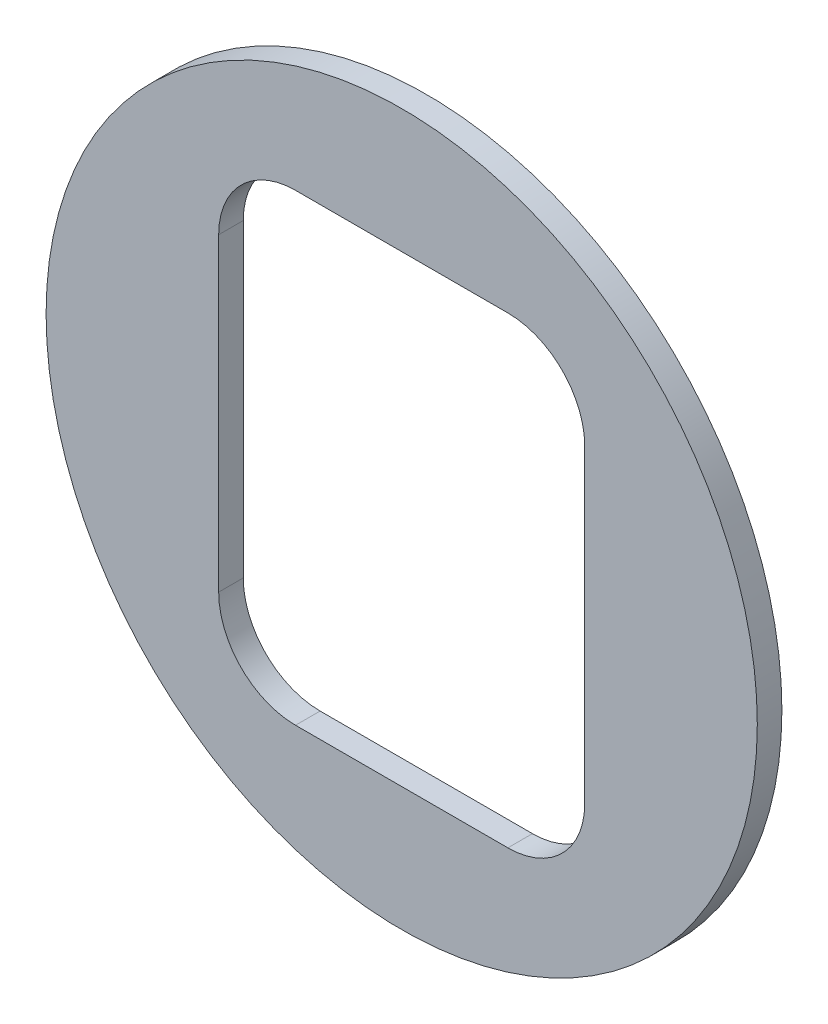
ISO-10303-21;
HEADER;
FILE_DESCRIPTION(('STEP AP214'),'2;1');
FILE_NAME('part.step','',(''),(''),'','','');
FILE_SCHEMA(('AUTOMOTIVE_DESIGN { 1 0 10303 214 1 1 1 1 }'));
ENDSEC;
DATA;
#1=APPLICATION_CONTEXT('core data for automotive mechanical design processes');
#2=APPLICATION_PROTOCOL_DEFINITION('international standard','automotive_design',2000,#1);
#3=PRODUCT_CONTEXT('',#1,'mechanical');
#4=PRODUCT('Part','Part','',(#3));
#5=PRODUCT_RELATED_PRODUCT_CATEGORY('part','',(#4));
#6=PRODUCT_DEFINITION_FORMATION('','',#4);
#7=PRODUCT_DEFINITION_CONTEXT('part definition',#1,'design');
#8=PRODUCT_DEFINITION('design','',#6,#7);
#9=PRODUCT_DEFINITION_SHAPE('','',#8);
#10=(LENGTH_UNIT() NAMED_UNIT(*) SI_UNIT(.MILLI.,.METRE.));
#11=(NAMED_UNIT(*) PLANE_ANGLE_UNIT() SI_UNIT($,.RADIAN.));
#12=(NAMED_UNIT(*) SI_UNIT($,.STERADIAN.) SOLID_ANGLE_UNIT());
#13=UNCERTAINTY_MEASURE_WITH_UNIT(LENGTH_MEASURE(1.E-05),#10,'distance_accuracy_value','');
#14=(GEOMETRIC_REPRESENTATION_CONTEXT(3) GLOBAL_UNCERTAINTY_ASSIGNED_CONTEXT((#13)) GLOBAL_UNIT_ASSIGNED_CONTEXT((#10,
#11,#12)) REPRESENTATION_CONTEXT('',''));
#15=CARTESIAN_POINT('',(0.,0.,0.));
#16=DIRECTION('',(0.,0.,1.));
#17=DIRECTION('',(1.,0.,0.));
#18=AXIS2_PLACEMENT_3D('',#15,#16,#17);
#19=CARTESIAN_POINT('',(0.,0.,1.524));
#20=DIRECTION('',(0.,0.,1.));
#21=DIRECTION('',(1.,0.,0.));
#22=AXIS2_PLACEMENT_3D('',#19,#20,#21);
#23=PLANE('',#22);
#24=CARTESIAN_POINT('',(0.,0.,1.524));
#25=DIRECTION('',(0.,0.,1.));
#26=DIRECTION('',(1.,0.,0.));
#27=AXIS2_PLACEMENT_3D('',#24,#25,#26);
#28=CIRCLE('',#27,22.0345);
#29=CARTESIAN_POINT('',(22.0345,0.,1.524));
#30=VERTEX_POINT('',#29);
#31=EDGE_CURVE('E128',#30,#30,#28,.T.);
#32=ORIENTED_EDGE('',*,*,#31,.T.);
#33=EDGE_LOOP('',(#32));
#34=FACE_BOUND('',#33,.T.);
#35=DIRECTION('',(1.,0.,0.));
#36=VECTOR('',#35,1.);
#37=CARTESIAN_POINT('',(-11.3411,-14.351,1.524));
#38=LINE('',#37,#36);
#39=CARTESIAN_POINT('',(-6.57860000000001,-14.351,1.524));
#40=VERTEX_POINT('',#39);
#41=CARTESIAN_POINT('',(6.57859999999999,-14.351,1.524));
#42=VERTEX_POINT('',#41);
#43=EDGE_CURVE('E173',#40,#42,#38,.T.);
#44=ORIENTED_EDGE('',*,*,#43,.F.);
#45=CARTESIAN_POINT('',(-6.57860000000001,-9.5885,1.524));
#46=DIRECTION('',(0.,0.,1.));
#47=DIRECTION('',(1.,0.,0.));
#48=AXIS2_PLACEMENT_3D('',#45,#46,#47);
#49=CIRCLE('',#48,4.7625);
#50=CARTESIAN_POINT('',(-11.3411,-9.5885,1.524));
#51=VERTEX_POINT('',#50);
#52=EDGE_CURVE('E151',#40,#51,#49,.F.);
#53=ORIENTED_EDGE('',*,*,#52,.T.);
#54=DIRECTION('',(0.,-1.,0.));
#55=VECTOR('',#54,1.);
#56=CARTESIAN_POINT('',(-11.3411,14.351,1.524));
#57=LINE('',#56,#55);
#58=CARTESIAN_POINT('',(-11.3411,9.58849999999999,1.524));
#59=VERTEX_POINT('',#58);
#60=EDGE_CURVE('E178',#59,#51,#57,.T.);
#61=ORIENTED_EDGE('',*,*,#60,.F.);
#62=CARTESIAN_POINT('',(-6.57860000000001,9.58849999999999,1.524));
#63=DIRECTION('',(0.,0.,1.));
#64=DIRECTION('',(1.,0.,0.));
#65=AXIS2_PLACEMENT_3D('',#62,#63,#64);
#66=CIRCLE('',#65,4.7625);
#67=CARTESIAN_POINT('',(-6.57860000000001,14.351,1.524));
#68=VERTEX_POINT('',#67);
#69=EDGE_CURVE('E13',#59,#68,#66,.F.);
#70=ORIENTED_EDGE('',*,*,#69,.T.);
#71=DIRECTION('',(-1.,0.,0.));
#72=VECTOR('',#71,1.);
#73=CARTESIAN_POINT('',(-11.3411,14.351,1.524));
#74=LINE('',#73,#72);
#75=CARTESIAN_POINT('',(6.57859999999999,14.351,1.524));
#76=VERTEX_POINT('',#75);
#77=EDGE_CURVE('E165',#76,#68,#74,.T.);
#78=ORIENTED_EDGE('',*,*,#77,.F.);
#79=CARTESIAN_POINT('',(6.57859999999999,9.58849999999999,1.524));
#80=DIRECTION('',(0.,0.,1.));
#81=DIRECTION('',(1.,0.,0.));
#82=AXIS2_PLACEMENT_3D('',#79,#80,#81);
#83=CIRCLE('',#82,4.7625);
#84=CARTESIAN_POINT('',(11.3411,9.58849999999999,1.524));
#85=VERTEX_POINT('',#84);
#86=EDGE_CURVE('E118',#76,#85,#83,.F.);
#87=ORIENTED_EDGE('',*,*,#86,.T.);
#88=DIRECTION('',(0.,1.,0.));
#89=VECTOR('',#88,1.);
#90=CARTESIAN_POINT('',(11.3411,14.351,1.524));
#91=LINE('',#90,#89);
#92=CARTESIAN_POINT('',(11.3411,-9.5885,1.524));
#93=VERTEX_POINT('',#92);
#94=EDGE_CURVE('E163',#93,#85,#91,.T.);
#95=ORIENTED_EDGE('',*,*,#94,.F.);
#96=CARTESIAN_POINT('',(6.57859999999999,-9.5885,1.524));
#97=DIRECTION('',(0.,0.,1.));
#98=DIRECTION('',(1.,0.,0.));
#99=AXIS2_PLACEMENT_3D('',#96,#97,#98);
#100=CIRCLE('',#99,4.7625);
#101=EDGE_CURVE('E155',#93,#42,#100,.F.);
#102=ORIENTED_EDGE('',*,*,#101,.T.);
#103=EDGE_LOOP('',(#44,#53,#61,#70,#78,#87,#95,#102));
#104=FACE_BOUND('',#103,.T.);
#105=ADVANCED_FACE('F45',(#34,#104),#23,.T.);
#106=CARTESIAN_POINT('',(0.,0.,0.));
#107=DIRECTION('',(0.,0.,1.));
#108=DIRECTION('',(1.,0.,0.));
#109=AXIS2_PLACEMENT_3D('',#106,#107,#108);
#110=PLANE('',#109);
#111=CARTESIAN_POINT('',(0.,0.,0.));
#112=DIRECTION('',(0.,0.,1.));
#113=DIRECTION('',(1.,0.,0.));
#114=AXIS2_PLACEMENT_3D('',#111,#112,#113);
#115=CIRCLE('',#114,22.0345);
#116=CARTESIAN_POINT('',(22.0345,0.,0.));
#117=VERTEX_POINT('',#116);
#118=EDGE_CURVE('E133',#117,#117,#115,.T.);
#119=ORIENTED_EDGE('',*,*,#118,.F.);
#120=EDGE_LOOP('',(#119));
#121=FACE_BOUND('',#120,.T.);
#122=DIRECTION('',(-1.,0.,0.));
#123=VECTOR('',#122,1.);
#124=CARTESIAN_POINT('',(-11.3411,14.351,0.));
#125=LINE('',#124,#123);
#126=CARTESIAN_POINT('',(6.57859999999999,14.351,0.));
#127=VERTEX_POINT('',#126);
#128=CARTESIAN_POINT('',(-6.57860000000001,14.351,0.));
#129=VERTEX_POINT('',#128);
#130=EDGE_CURVE('E113',#127,#129,#125,.T.);
#131=ORIENTED_EDGE('',*,*,#130,.T.);
#132=CARTESIAN_POINT('',(-6.57860000000001,9.58849999999999,0.));
#133=DIRECTION('',(0.,0.,1.));
#134=DIRECTION('',(1.,0.,0.));
#135=AXIS2_PLACEMENT_3D('',#132,#133,#134);
#136=CIRCLE('',#135,4.7625);
#137=CARTESIAN_POINT('',(-11.3411,9.58849999999999,0.));
#138=VERTEX_POINT('',#137);
#139=EDGE_CURVE('E53',#129,#138,#136,.T.);
#140=ORIENTED_EDGE('',*,*,#139,.T.);
#141=DIRECTION('',(0.,-1.,0.));
#142=VECTOR('',#141,1.);
#143=CARTESIAN_POINT('',(-11.3411,14.351,0.));
#144=LINE('',#143,#142);
#145=CARTESIAN_POINT('',(-11.3411,-9.5885,0.));
#146=VERTEX_POINT('',#145);
#147=EDGE_CURVE('E112',#138,#146,#144,.T.);
#148=ORIENTED_EDGE('',*,*,#147,.T.);
#149=CARTESIAN_POINT('',(-6.57860000000001,-9.5885,0.));
#150=DIRECTION('',(0.,0.,1.));
#151=DIRECTION('',(1.,0.,0.));
#152=AXIS2_PLACEMENT_3D('',#149,#150,#151);
#153=CIRCLE('',#152,4.7625);
#154=CARTESIAN_POINT('',(-6.57860000000001,-14.351,0.));
#155=VERTEX_POINT('',#154);
#156=EDGE_CURVE('E149',#146,#155,#153,.T.);
#157=ORIENTED_EDGE('',*,*,#156,.T.);
#158=DIRECTION('',(1.,0.,0.));
#159=VECTOR('',#158,1.);
#160=CARTESIAN_POINT('',(-11.3411,-14.351,0.));
#161=LINE('',#160,#159);
#162=CARTESIAN_POINT('',(6.57859999999999,-14.351,0.));
#163=VERTEX_POINT('',#162);
#164=EDGE_CURVE('E126',#155,#163,#161,.T.);
#165=ORIENTED_EDGE('',*,*,#164,.T.);
#166=CARTESIAN_POINT('',(6.57859999999999,-9.5885,0.));
#167=DIRECTION('',(0.,0.,1.));
#168=DIRECTION('',(1.,0.,0.));
#169=AXIS2_PLACEMENT_3D('',#166,#167,#168);
#170=CIRCLE('',#169,4.7625);
#171=CARTESIAN_POINT('',(11.3411,-9.5885,0.));
#172=VERTEX_POINT('',#171);
#173=EDGE_CURVE('E153',#163,#172,#170,.T.);
#174=ORIENTED_EDGE('',*,*,#173,.T.);
#175=DIRECTION('',(0.,1.,0.));
#176=VECTOR('',#175,1.);
#177=CARTESIAN_POINT('',(11.3411,14.351,0.));
#178=LINE('',#177,#176);
#179=CARTESIAN_POINT('',(11.3411,9.58849999999999,0.));
#180=VERTEX_POINT('',#179);
#181=EDGE_CURVE('E176',#172,#180,#178,.T.);
#182=ORIENTED_EDGE('',*,*,#181,.T.);
#183=CARTESIAN_POINT('',(6.57859999999999,9.58849999999999,0.));
#184=DIRECTION('',(0.,0.,1.));
#185=DIRECTION('',(1.,0.,0.));
#186=AXIS2_PLACEMENT_3D('',#183,#184,#185);
#187=CIRCLE('',#186,4.7625);
#188=EDGE_CURVE('E157',#180,#127,#187,.T.);
#189=ORIENTED_EDGE('',*,*,#188,.T.);
#190=EDGE_LOOP('',(#131,#140,#148,#157,#165,#174,#182,#189));
#191=FACE_BOUND('',#190,.T.);
#192=ADVANCED_FACE('F111',(#121,#191),#110,.F.);
#193=CARTESIAN_POINT('',(0.,0.,1.524));
#194=DIRECTION('',(0.,0.,-1.));
#195=DIRECTION('',(-1.,0.,0.));
#196=AXIS2_PLACEMENT_3D('',#193,#194,#195);
#197=CYLINDRICAL_SURFACE('',#196,22.0345);
#198=ORIENTED_EDGE('',*,*,#31,.F.);
#199=EDGE_LOOP('',(#198));
#200=FACE_BOUND('',#199,.T.);
#201=ORIENTED_EDGE('',*,*,#118,.T.);
#202=EDGE_LOOP('',(#201));
#203=FACE_BOUND('',#202,.T.);
#204=ADVANCED_FACE('F212',(#200,#203),#197,.T.);
#205=CARTESIAN_POINT('',(-11.3411,14.351,1.524));
#206=DIRECTION('',(1.,0.,0.));
#207=DIRECTION('',(0.,1.,0.));
#208=AXIS2_PLACEMENT_3D('',#205,#206,#207);
#209=PLANE('',#208);
#210=ORIENTED_EDGE('',*,*,#60,.T.);
#211=DIRECTION('',(0.,0.,-1.));
#212=VECTOR('',#211,1.);
#213=CARTESIAN_POINT('',(-11.3411,-9.5885,0.));
#214=LINE('',#213,#212);
#215=EDGE_CURVE('E125',#51,#146,#214,.T.);
#216=ORIENTED_EDGE('',*,*,#215,.T.);
#217=ORIENTED_EDGE('',*,*,#147,.F.);
#218=DIRECTION('',(0.,0.,-1.));
#219=VECTOR('',#218,1.);
#220=CARTESIAN_POINT('',(-11.3411,9.58849999999999,1.524));
#221=LINE('',#220,#219);
#222=EDGE_CURVE('E123',#138,#59,#221,.F.);
#223=ORIENTED_EDGE('',*,*,#222,.T.);
#224=EDGE_LOOP('',(#210,#216,#217,#223));
#225=FACE_BOUND('',#224,.T.);
#226=ADVANCED_FACE('F122',(#225),#209,.T.);
#227=CARTESIAN_POINT('',(-11.3411,-14.351,1.524));
#228=DIRECTION('',(0.,1.,0.));
#229=DIRECTION('',(0.,0.,1.));
#230=AXIS2_PLACEMENT_3D('',#227,#228,#229);
#231=PLANE('',#230);
#232=ORIENTED_EDGE('',*,*,#164,.F.);
#233=DIRECTION('',(0.,0.,-1.));
#234=VECTOR('',#233,1.);
#235=CARTESIAN_POINT('',(-6.57860000000001,-14.351,1.524));
#236=LINE('',#235,#234);
#237=EDGE_CURVE('E139',#155,#40,#236,.F.);
#238=ORIENTED_EDGE('',*,*,#237,.T.);
#239=ORIENTED_EDGE('',*,*,#43,.T.);
#240=DIRECTION('',(0.,0.,-1.));
#241=VECTOR('',#240,1.);
#242=CARTESIAN_POINT('',(6.57859999999999,-14.351,0.));
#243=LINE('',#242,#241);
#244=EDGE_CURVE('E130',#42,#163,#243,.T.);
#245=ORIENTED_EDGE('',*,*,#244,.T.);
#246=EDGE_LOOP('',(#232,#238,#239,#245));
#247=FACE_BOUND('',#246,.T.);
#248=ADVANCED_FACE('F190',(#247),#231,.T.);
#249=CARTESIAN_POINT('',(11.3411,14.351,1.524));
#250=DIRECTION('',(-1.,0.,0.));
#251=DIRECTION('',(0.,-1.,0.));
#252=AXIS2_PLACEMENT_3D('',#249,#250,#251);
#253=PLANE('',#252);
#254=ORIENTED_EDGE('',*,*,#181,.F.);
#255=DIRECTION('',(0.,0.,-1.));
#256=VECTOR('',#255,1.);
#257=CARTESIAN_POINT('',(11.3411,-9.5885,1.524));
#258=LINE('',#257,#256);
#259=EDGE_CURVE('E144',#172,#93,#258,.F.);
#260=ORIENTED_EDGE('',*,*,#259,.T.);
#261=ORIENTED_EDGE('',*,*,#94,.T.);
#262=DIRECTION('',(0.,0.,-1.));
#263=VECTOR('',#262,1.);
#264=CARTESIAN_POINT('',(11.3411,9.58849999999999,0.));
#265=LINE('',#264,#263);
#266=EDGE_CURVE('E141',#85,#180,#265,.T.);
#267=ORIENTED_EDGE('',*,*,#266,.T.);
#268=EDGE_LOOP('',(#254,#260,#261,#267));
#269=FACE_BOUND('',#268,.T.);
#270=ADVANCED_FACE('F170',(#269),#253,.T.);
#271=CARTESIAN_POINT('',(-11.3411,14.351,1.524));
#272=DIRECTION('',(0.,-1.,0.));
#273=DIRECTION('',(0.,0.,-1.));
#274=AXIS2_PLACEMENT_3D('',#271,#272,#273);
#275=PLANE('',#274);
#276=ORIENTED_EDGE('',*,*,#130,.F.);
#277=DIRECTION('',(0.,0.,-1.));
#278=VECTOR('',#277,1.);
#279=CARTESIAN_POINT('',(6.57859999999999,14.351,1.524));
#280=LINE('',#279,#278);
#281=EDGE_CURVE('E65',#127,#76,#280,.F.);
#282=ORIENTED_EDGE('',*,*,#281,.T.);
#283=ORIENTED_EDGE('',*,*,#77,.T.);
#284=DIRECTION('',(0.,0.,-1.));
#285=VECTOR('',#284,1.);
#286=CARTESIAN_POINT('',(-6.57860000000001,14.351,0.));
#287=LINE('',#286,#285);
#288=EDGE_CURVE('E146',#68,#129,#287,.T.);
#289=ORIENTED_EDGE('',*,*,#288,.T.);
#290=EDGE_LOOP('',(#276,#282,#283,#289));
#291=FACE_BOUND('',#290,.T.);
#292=ADVANCED_FACE('F177',(#291),#275,.T.);
#293=CARTESIAN_POINT('',(-6.57860000000001,-9.5885,1.524));
#294=DIRECTION('',(0.,0.,1.));
#295=DIRECTION('',(1.,0.,0.));
#296=AXIS2_PLACEMENT_3D('',#293,#294,#295);
#297=CYLINDRICAL_SURFACE('',#296,4.7625);
#298=ORIENTED_EDGE('',*,*,#52,.F.);
#299=ORIENTED_EDGE('',*,*,#237,.F.);
#300=ORIENTED_EDGE('',*,*,#156,.F.);
#301=ORIENTED_EDGE('',*,*,#215,.F.);
#302=EDGE_LOOP('',(#298,#299,#300,#301));
#303=FACE_BOUND('',#302,.T.);
#304=ADVANCED_FACE('F196',(#303),#297,.F.);
#305=CARTESIAN_POINT('',(6.57859999999999,-9.5885,1.524));
#306=DIRECTION('',(0.,0.,1.));
#307=DIRECTION('',(1.,0.,0.));
#308=AXIS2_PLACEMENT_3D('',#305,#306,#307);
#309=CYLINDRICAL_SURFACE('',#308,4.7625);
#310=ORIENTED_EDGE('',*,*,#101,.F.);
#311=ORIENTED_EDGE('',*,*,#259,.F.);
#312=ORIENTED_EDGE('',*,*,#173,.F.);
#313=ORIENTED_EDGE('',*,*,#244,.F.);
#314=EDGE_LOOP('',(#310,#311,#312,#313));
#315=FACE_BOUND('',#314,.T.);
#316=ADVANCED_FACE('F194',(#315),#309,.F.);
#317=CARTESIAN_POINT('',(6.57859999999999,9.58849999999999,1.524));
#318=DIRECTION('',(0.,0.,1.));
#319=DIRECTION('',(1.,0.,0.));
#320=AXIS2_PLACEMENT_3D('',#317,#318,#319);
#321=CYLINDRICAL_SURFACE('',#320,4.7625);
#322=ORIENTED_EDGE('',*,*,#86,.F.);
#323=ORIENTED_EDGE('',*,*,#281,.F.);
#324=ORIENTED_EDGE('',*,*,#188,.F.);
#325=ORIENTED_EDGE('',*,*,#266,.F.);
#326=EDGE_LOOP('',(#322,#323,#324,#325));
#327=FACE_BOUND('',#326,.T.);
#328=ADVANCED_FACE('F175',(#327),#321,.F.);
#329=CARTESIAN_POINT('',(-6.57860000000001,9.58849999999999,1.524));
#330=DIRECTION('',(0.,0.,1.));
#331=DIRECTION('',(1.,0.,0.));
#332=AXIS2_PLACEMENT_3D('',#329,#330,#331);
#333=CYLINDRICAL_SURFACE('',#332,4.7625);
#334=ORIENTED_EDGE('',*,*,#69,.F.);
#335=ORIENTED_EDGE('',*,*,#222,.F.);
#336=ORIENTED_EDGE('',*,*,#139,.F.);
#337=ORIENTED_EDGE('',*,*,#288,.F.);
#338=EDGE_LOOP('',(#334,#335,#336,#337));
#339=FACE_BOUND('',#338,.T.);
#340=ADVANCED_FACE('F47',(#339),#333,.F.);
#341=CLOSED_SHELL('',(#105,#192,#204,#226,#248,#270,#292,#304,#316,#328,#340));
#342=MANIFOLD_SOLID_BREP('B2',#341);
#343=ADVANCED_BREP_SHAPE_REPRESENTATION('',(#18,#342),#14);
#344=SHAPE_DEFINITION_REPRESENTATION(#9,#343);
ENDSEC;
END-ISO-10303-21;
